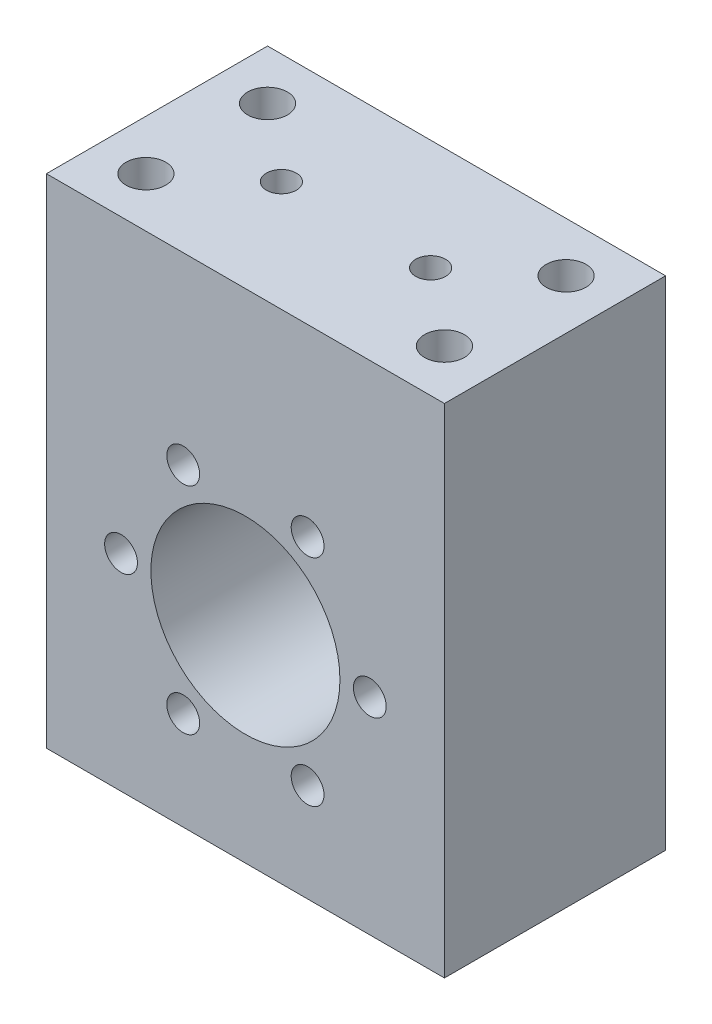
ISO-10303-21;
HEADER;
FILE_DESCRIPTION(('STEP AP214'),'2;1');
FILE_NAME('part.step','',(''),(''),'','','');
FILE_SCHEMA(('AUTOMOTIVE_DESIGN { 1 0 10303 214 1 1 1 1 }'));
ENDSEC;
DATA;
#1=APPLICATION_CONTEXT('core data for automotive mechanical design processes');
#2=APPLICATION_PROTOCOL_DEFINITION('international standard','automotive_design',2000,#1);
#3=PRODUCT_CONTEXT('',#1,'mechanical');
#4=PRODUCT('Part','Part','',(#3));
#5=PRODUCT_RELATED_PRODUCT_CATEGORY('part','',(#4));
#6=PRODUCT_DEFINITION_FORMATION('','',#4);
#7=PRODUCT_DEFINITION_CONTEXT('part definition',#1,'design');
#8=PRODUCT_DEFINITION('design','',#6,#7);
#9=PRODUCT_DEFINITION_SHAPE('','',#8);
#10=(LENGTH_UNIT() NAMED_UNIT(*) SI_UNIT(.MILLI.,.METRE.));
#11=(NAMED_UNIT(*) PLANE_ANGLE_UNIT() SI_UNIT($,.RADIAN.));
#12=(NAMED_UNIT(*) SI_UNIT($,.STERADIAN.) SOLID_ANGLE_UNIT());
#13=UNCERTAINTY_MEASURE_WITH_UNIT(LENGTH_MEASURE(1.E-05),#10,'distance_accuracy_value','');
#14=(GEOMETRIC_REPRESENTATION_CONTEXT(3) GLOBAL_UNCERTAINTY_ASSIGNED_CONTEXT((#13)) GLOBAL_UNIT_ASSIGNED_CONTEXT((#10,
#11,#12)) REPRESENTATION_CONTEXT('',''));
#15=CARTESIAN_POINT('',(0.,0.,0.));
#16=DIRECTION('',(0.,0.,1.));
#17=DIRECTION('',(1.,0.,0.));
#18=AXIS2_PLACEMENT_3D('',#15,#16,#17);
#19=CARTESIAN_POINT('',(40.,-58.6,22.225));
#20=DIRECTION('',(-1.,0.,0.));
#21=DIRECTION('',(0.,0.,1.));
#22=AXIS2_PLACEMENT_3D('',#19,#20,#21);
#23=PLANE('',#22);
#24=DIRECTION('',(0.,1.,0.));
#25=VECTOR('',#24,1.);
#26=CARTESIAN_POINT('',(40.,-58.6,22.225));
#27=LINE('',#26,#25);
#28=CARTESIAN_POINT('',(40.,-41.4,22.225));
#29=VERTEX_POINT('',#28);
#30=CARTESIAN_POINT('',(40.,58.6,22.225));
#31=VERTEX_POINT('',#30);
#32=EDGE_CURVE('E98',#29,#31,#27,.T.);
#33=ORIENTED_EDGE('',*,*,#32,.F.);
#34=DIRECTION('',(0.,0.,1.));
#35=VECTOR('',#34,1.);
#36=CARTESIAN_POINT('',(40.,-41.4,-22.225));
#37=LINE('',#36,#35);
#38=CARTESIAN_POINT('',(40.,-41.4,-22.225));
#39=VERTEX_POINT('',#38);
#40=EDGE_CURVE('E213',#39,#29,#37,.T.);
#41=ORIENTED_EDGE('',*,*,#40,.F.);
#42=DIRECTION('',(0.,1.,0.));
#43=VECTOR('',#42,1.);
#44=CARTESIAN_POINT('',(40.,-58.6,-22.225));
#45=LINE('',#44,#43);
#46=CARTESIAN_POINT('',(40.,58.6,-22.225));
#47=VERTEX_POINT('',#46);
#48=EDGE_CURVE('E87',#39,#47,#45,.T.);
#49=ORIENTED_EDGE('',*,*,#48,.T.);
#50=DIRECTION('',(0.,0.,-1.));
#51=VECTOR('',#50,1.);
#52=CARTESIAN_POINT('',(40.,58.6,22.225));
#53=LINE('',#52,#51);
#54=EDGE_CURVE('E11',#31,#47,#53,.T.);
#55=ORIENTED_EDGE('',*,*,#54,.F.);
#56=EDGE_LOOP('',(#33,#41,#49,#55));
#57=FACE_BOUND('',#56,.T.);
#58=ADVANCED_FACE('F41',(#57),#23,.F.);
#59=CARTESIAN_POINT('',(-40.,58.6,22.225));
#60=DIRECTION('',(0.,-1.,0.));
#61=DIRECTION('',(0.,0.,-1.));
#62=AXIS2_PLACEMENT_3D('',#59,#60,#61);
#63=PLANE('',#62);
#64=CARTESIAN_POINT('',(15.,58.6,0.));
#65=DIRECTION('',(0.,1.,0.));
#66=DIRECTION('',(0.,0.,1.));
#67=AXIS2_PLACEMENT_3D('',#64,#65,#66);
#68=CIRCLE('',#67,3.);
#69=CARTESIAN_POINT('',(15.,58.6,3.));
#70=VERTEX_POINT('',#69);
#71=EDGE_CURVE('E206',#70,#70,#68,.T.);
#72=ORIENTED_EDGE('',*,*,#71,.F.);
#73=EDGE_LOOP('',(#72));
#74=FACE_BOUND('',#73,.T.);
#75=CARTESIAN_POINT('',(-15.,58.6,0.));
#76=DIRECTION('',(0.,1.,0.));
#77=DIRECTION('',(0.,0.,1.));
#78=AXIS2_PLACEMENT_3D('',#75,#76,#77);
#79=CIRCLE('',#78,3.);
#80=CARTESIAN_POINT('',(-15.,58.6,3.));
#81=VERTEX_POINT('',#80);
#82=EDGE_CURVE('E198',#81,#81,#79,.T.);
#83=ORIENTED_EDGE('',*,*,#82,.F.);
#84=EDGE_LOOP('',(#83));
#85=FACE_BOUND('',#84,.T.);
#86=CARTESIAN_POINT('',(30.,58.6,12.225));
#87=DIRECTION('',(0.,1.,0.));
#88=DIRECTION('',(0.,0.,1.));
#89=AXIS2_PLACEMENT_3D('',#86,#87,#88);
#90=CIRCLE('',#89,4.);
#91=CARTESIAN_POINT('',(30.,58.6,16.225));
#92=VERTEX_POINT('',#91);
#93=EDGE_CURVE('E190',#92,#92,#90,.T.);
#94=ORIENTED_EDGE('',*,*,#93,.F.);
#95=EDGE_LOOP('',(#94));
#96=FACE_BOUND('',#95,.T.);
#97=CARTESIAN_POINT('',(-30.,58.6,12.225));
#98=DIRECTION('',(0.,1.,0.));
#99=DIRECTION('',(0.,0.,1.));
#100=AXIS2_PLACEMENT_3D('',#97,#98,#99);
#101=CIRCLE('',#100,4.);
#102=CARTESIAN_POINT('',(-30.,58.6,16.225));
#103=VERTEX_POINT('',#102);
#104=EDGE_CURVE('E182',#103,#103,#101,.T.);
#105=ORIENTED_EDGE('',*,*,#104,.F.);
#106=EDGE_LOOP('',(#105));
#107=FACE_BOUND('',#106,.T.);
#108=CARTESIAN_POINT('',(30.,58.6,-12.225));
#109=DIRECTION('',(0.,1.,0.));
#110=DIRECTION('',(0.,0.,1.));
#111=AXIS2_PLACEMENT_3D('',#108,#109,#110);
#112=CIRCLE('',#111,4.);
#113=CARTESIAN_POINT('',(30.,58.6,-8.225));
#114=VERTEX_POINT('',#113);
#115=EDGE_CURVE('E174',#114,#114,#112,.T.);
#116=ORIENTED_EDGE('',*,*,#115,.F.);
#117=EDGE_LOOP('',(#116));
#118=FACE_BOUND('',#117,.T.);
#119=CARTESIAN_POINT('',(-30.,58.6,-12.225));
#120=DIRECTION('',(0.,1.,0.));
#121=DIRECTION('',(0.,0.,1.));
#122=AXIS2_PLACEMENT_3D('',#119,#120,#121);
#123=CIRCLE('',#122,4.);
#124=CARTESIAN_POINT('',(-30.,58.6,-8.225));
#125=VERTEX_POINT('',#124);
#126=EDGE_CURVE('E166',#125,#125,#123,.T.);
#127=ORIENTED_EDGE('',*,*,#126,.F.);
#128=EDGE_LOOP('',(#127));
#129=FACE_BOUND('',#128,.T.);
#130=DIRECTION('',(-1.,0.,0.));
#131=VECTOR('',#130,1.);
#132=CARTESIAN_POINT('',(-40.,58.6,-22.225));
#133=LINE('',#132,#131);
#134=CARTESIAN_POINT('',(-40.,58.6,-22.225));
#135=VERTEX_POINT('',#134);
#136=EDGE_CURVE('E77',#47,#135,#133,.T.);
#137=ORIENTED_EDGE('',*,*,#136,.T.);
#138=DIRECTION('',(0.,0.,-1.));
#139=VECTOR('',#138,1.);
#140=CARTESIAN_POINT('',(-40.,58.6,22.225));
#141=LINE('',#140,#139);
#142=CARTESIAN_POINT('',(-40.,58.6,22.225));
#143=VERTEX_POINT('',#142);
#144=EDGE_CURVE('E49',#143,#135,#141,.T.);
#145=ORIENTED_EDGE('',*,*,#144,.F.);
#146=DIRECTION('',(-1.,0.,0.));
#147=VECTOR('',#146,1.);
#148=CARTESIAN_POINT('',(-40.,58.6,22.225));
#149=LINE('',#148,#147);
#150=EDGE_CURVE('E65',#31,#143,#149,.T.);
#151=ORIENTED_EDGE('',*,*,#150,.F.);
#152=ORIENTED_EDGE('',*,*,#54,.T.);
#153=EDGE_LOOP('',(#137,#145,#151,#152));
#154=FACE_BOUND('',#153,.T.);
#155=ADVANCED_FACE('F79',(#74,#85,#96,#107,#118,#129,#154),#63,.F.);
#156=CARTESIAN_POINT('',(-40.,-58.6,22.225));
#157=DIRECTION('',(1.,0.,0.));
#158=DIRECTION('',(0.,0.,-1.));
#159=AXIS2_PLACEMENT_3D('',#156,#157,#158);
#160=PLANE('',#159);
#161=DIRECTION('',(0.,-1.,0.));
#162=VECTOR('',#161,1.);
#163=CARTESIAN_POINT('',(-40.,-58.6,-22.225));
#164=LINE('',#163,#162);
#165=CARTESIAN_POINT('',(-40.,-41.4,-22.225));
#166=VERTEX_POINT('',#165);
#167=EDGE_CURVE('E86',#135,#166,#164,.T.);
#168=ORIENTED_EDGE('',*,*,#167,.T.);
#169=DIRECTION('',(0.,0.,1.));
#170=VECTOR('',#169,1.);
#171=CARTESIAN_POINT('',(-40.,-41.4,-22.225));
#172=LINE('',#171,#170);
#173=CARTESIAN_POINT('',(-40.,-41.4,22.225));
#174=VERTEX_POINT('',#173);
#175=EDGE_CURVE('E56',#166,#174,#172,.T.);
#176=ORIENTED_EDGE('',*,*,#175,.T.);
#177=DIRECTION('',(0.,-1.,0.));
#178=VECTOR('',#177,1.);
#179=CARTESIAN_POINT('',(-40.,-58.6,22.225));
#180=LINE('',#179,#178);
#181=EDGE_CURVE('E92',#143,#174,#180,.T.);
#182=ORIENTED_EDGE('',*,*,#181,.F.);
#183=ORIENTED_EDGE('',*,*,#144,.T.);
#184=EDGE_LOOP('',(#168,#176,#182,#183));
#185=FACE_BOUND('',#184,.T.);
#186=ADVANCED_FACE('F91',(#185),#160,.F.);
#187=CARTESIAN_POINT('',(0.,0.,22.225));
#188=DIRECTION('',(0.,0.,-1.));
#189=DIRECTION('',(-1.,0.,0.));
#190=AXIS2_PLACEMENT_3D('',#187,#188,#189);
#191=PLANE('',#190);
#192=CARTESIAN_POINT('',(25.,2.9316826744008E-13,22.225));
#193=DIRECTION('',(0.,0.,1.));
#194=DIRECTION('',(0.50000000000001,-0.866025403784433,0.));
#195=AXIS2_PLACEMENT_3D('',#192,#193,#194);
#196=CIRCLE('',#195,3.3);
#197=CARTESIAN_POINT('',(26.65,-2.85788383248834,22.225));
#198=VERTEX_POINT('',#197);
#199=EDGE_CURVE('E158',#198,#198,#196,.T.);
#200=ORIENTED_EDGE('',*,*,#199,.F.);
#201=EDGE_LOOP('',(#200));
#202=FACE_BOUND('',#201,.T.);
#203=CARTESIAN_POINT('',(12.5000000000002,-21.6506350946108,22.225));
#204=DIRECTION('',(0.,0.,1.));
#205=DIRECTION('',(-0.499999999999992,-0.866025403784443,0.));
#206=AXIS2_PLACEMENT_3D('',#203,#204,#205);
#207=CIRCLE('',#206,3.3);
#208=CARTESIAN_POINT('',(10.8500000000002,-24.5085189270995,22.225));
#209=VERTEX_POINT('',#208);
#210=EDGE_CURVE('E150',#209,#209,#207,.T.);
#211=ORIENTED_EDGE('',*,*,#210,.F.);
#212=EDGE_LOOP('',(#211));
#213=FACE_BOUND('',#212,.T.);
#214=CARTESIAN_POINT('',(-12.5,-21.650635094611,22.225));
#215=DIRECTION('',(0.,0.,1.));
#216=DIRECTION('',(-1.,0.,0.));
#217=AXIS2_PLACEMENT_3D('',#214,#215,#216);
#218=CIRCLE('',#217,3.3);
#219=CARTESIAN_POINT('',(-15.8,-21.650635094611,22.225));
#220=VERTEX_POINT('',#219);
#221=EDGE_CURVE('E142',#220,#220,#218,.T.);
#222=ORIENTED_EDGE('',*,*,#221,.F.);
#223=EDGE_LOOP('',(#222));
#224=FACE_BOUND('',#223,.T.);
#225=CARTESIAN_POINT('',(-25.,-1.16226472890446E-13,22.225));
#226=DIRECTION('',(0.,0.,1.));
#227=DIRECTION('',(-0.500000000000004,0.866025403784436,0.));
#228=AXIS2_PLACEMENT_3D('',#225,#226,#227);
#229=CIRCLE('',#228,3.3);
#230=CARTESIAN_POINT('',(-26.65,2.85788383248853,22.225));
#231=VERTEX_POINT('',#230);
#232=EDGE_CURVE('E134',#231,#231,#229,.T.);
#233=ORIENTED_EDGE('',*,*,#232,.F.);
#234=EDGE_LOOP('',(#233));
#235=FACE_BOUND('',#234,.T.);
#236=CARTESIAN_POINT('',(-12.5000000000001,21.6506350946109,22.225));
#237=DIRECTION('',(0.,0.,1.));
#238=DIRECTION('',(0.499999999999998,0.86602540378444,0.));
#239=AXIS2_PLACEMENT_3D('',#236,#237,#238);
#240=CIRCLE('',#239,3.3);
#241=CARTESIAN_POINT('',(-10.8500000000001,24.5085189270996,22.225));
#242=VERTEX_POINT('',#241);
#243=EDGE_CURVE('E126',#242,#242,#240,.T.);
#244=ORIENTED_EDGE('',*,*,#243,.F.);
#245=EDGE_LOOP('',(#244));
#246=FACE_BOUND('',#245,.T.);
#247=CARTESIAN_POINT('',(12.5,21.650635094611,22.225));
#248=DIRECTION('',(0.,0.,1.));
#249=DIRECTION('',(1.,0.,0.));
#250=AXIS2_PLACEMENT_3D('',#247,#248,#249);
#251=CIRCLE('',#250,3.3);
#252=CARTESIAN_POINT('',(15.8,21.650635094611,22.225));
#253=VERTEX_POINT('',#252);
#254=EDGE_CURVE('E118',#253,#253,#251,.T.);
#255=ORIENTED_EDGE('',*,*,#254,.F.);
#256=EDGE_LOOP('',(#255));
#257=FACE_BOUND('',#256,.T.);
#258=CARTESIAN_POINT('',(0.,0.,22.225));
#259=DIRECTION('',(0.,0.,1.));
#260=DIRECTION('',(1.,0.,0.));
#261=AXIS2_PLACEMENT_3D('',#258,#259,#260);
#262=CIRCLE('',#261,19.);
#263=CARTESIAN_POINT('',(19.,0.,22.225));
#264=VERTEX_POINT('',#263);
#265=EDGE_CURVE('E110',#264,#264,#262,.T.);
#266=ORIENTED_EDGE('',*,*,#265,.F.);
#267=EDGE_LOOP('',(#266));
#268=FACE_BOUND('',#267,.T.);
#269=ORIENTED_EDGE('',*,*,#181,.T.);
#270=DIRECTION('',(-1.,0.,0.));
#271=VECTOR('',#270,1.);
#272=CARTESIAN_POINT('',(-40.,-41.4,22.225));
#273=LINE('',#272,#271);
#274=EDGE_CURVE('E219',#29,#174,#273,.T.);
#275=ORIENTED_EDGE('',*,*,#274,.F.);
#276=ORIENTED_EDGE('',*,*,#32,.T.);
#277=ORIENTED_EDGE('',*,*,#150,.T.);
#278=EDGE_LOOP('',(#269,#275,#276,#277));
#279=FACE_BOUND('',#278,.T.);
#280=ADVANCED_FACE('F229',(#202,#213,#224,#235,#246,#257,#268,#279),#191,.F.);
#281=CARTESIAN_POINT('',(0.,0.,-22.225));
#282=DIRECTION('',(0.,0.,-1.));
#283=DIRECTION('',(-1.,0.,0.));
#284=AXIS2_PLACEMENT_3D('',#281,#282,#283);
#285=PLANE('',#284);
#286=DIRECTION('',(-1.,0.,0.));
#287=VECTOR('',#286,1.);
#288=CARTESIAN_POINT('',(-40.,-41.4,-22.225));
#289=LINE('',#288,#287);
#290=EDGE_CURVE('E96',#39,#166,#289,.T.);
#291=ORIENTED_EDGE('',*,*,#290,.T.);
#292=ORIENTED_EDGE('',*,*,#167,.F.);
#293=ORIENTED_EDGE('',*,*,#136,.F.);
#294=ORIENTED_EDGE('',*,*,#48,.F.);
#295=EDGE_LOOP('',(#291,#292,#293,#294));
#296=FACE_BOUND('',#295,.T.);
#297=CARTESIAN_POINT('',(0.,0.,-22.225));
#298=DIRECTION('',(0.,0.,1.));
#299=DIRECTION('',(1.,0.,0.));
#300=AXIS2_PLACEMENT_3D('',#297,#298,#299);
#301=CIRCLE('',#300,19.);
#302=CARTESIAN_POINT('',(19.,0.,-22.225));
#303=VERTEX_POINT('',#302);
#304=EDGE_CURVE('E105',#303,#303,#301,.T.);
#305=ORIENTED_EDGE('',*,*,#304,.T.);
#306=EDGE_LOOP('',(#305));
#307=FACE_BOUND('',#306,.T.);
#308=ADVANCED_FACE('F94',(#296,#307),#285,.T.);
#309=CARTESIAN_POINT('',(0.,0.,-22.225));
#310=DIRECTION('',(0.,0.,1.));
#311=DIRECTION('',(1.,0.,0.));
#312=AXIS2_PLACEMENT_3D('',#309,#310,#311);
#313=CYLINDRICAL_SURFACE('',#312,19.);
#314=ORIENTED_EDGE('',*,*,#304,.F.);
#315=EDGE_LOOP('',(#314));
#316=FACE_BOUND('',#315,.T.);
#317=ORIENTED_EDGE('',*,*,#265,.T.);
#318=EDGE_LOOP('',(#317));
#319=FACE_BOUND('',#318,.T.);
#320=ADVANCED_FACE('F237',(#316,#319),#313,.F.);
#321=CARTESIAN_POINT('',(12.5,21.650635094611,-12.275));
#322=DIRECTION('',(0.,0.,1.));
#323=DIRECTION('',(1.,0.,0.));
#324=AXIS2_PLACEMENT_3D('',#321,#322,#323);
#325=CYLINDRICAL_SURFACE('',#324,3.3);
#326=CARTESIAN_POINT('',(12.5,21.650635094611,-12.275));
#327=DIRECTION('',(0.,0.,1.));
#328=DIRECTION('',(1.,0.,0.));
#329=AXIS2_PLACEMENT_3D('',#326,#327,#328);
#330=CIRCLE('',#329,3.3);
#331=CARTESIAN_POINT('',(15.8,21.650635094611,-12.275));
#332=VERTEX_POINT('',#331);
#333=EDGE_CURVE('E114',#332,#332,#330,.T.);
#334=ORIENTED_EDGE('',*,*,#333,.F.);
#335=EDGE_LOOP('',(#334));
#336=FACE_BOUND('',#335,.T.);
#337=ORIENTED_EDGE('',*,*,#254,.T.);
#338=EDGE_LOOP('',(#337));
#339=FACE_BOUND('',#338,.T.);
#340=ADVANCED_FACE('F322',(#336,#339),#325,.F.);
#341=CARTESIAN_POINT('',(12.5,21.650635094611,-12.275));
#342=DIRECTION('',(0.,0.,1.));
#343=DIRECTION('',(1.,0.,0.));
#344=AXIS2_PLACEMENT_3D('',#341,#342,#343);
#345=PLANE('',#344);
#346=ORIENTED_EDGE('',*,*,#333,.T.);
#347=EDGE_LOOP('',(#346));
#348=FACE_BOUND('',#347,.T.);
#349=ADVANCED_FACE('F318',(#348),#345,.T.);
#350=CARTESIAN_POINT('',(-12.5000000000001,21.6506350946109,-12.275));
#351=DIRECTION('',(0.,0.,1.));
#352=DIRECTION('',(1.,0.,0.));
#353=AXIS2_PLACEMENT_3D('',#350,#351,#352);
#354=CYLINDRICAL_SURFACE('',#353,3.3);
#355=CARTESIAN_POINT('',(-12.5000000000001,21.6506350946109,-12.275));
#356=DIRECTION('',(0.,0.,1.));
#357=DIRECTION('',(0.499999999999998,0.86602540378444,0.));
#358=AXIS2_PLACEMENT_3D('',#355,#356,#357);
#359=CIRCLE('',#358,3.3);
#360=CARTESIAN_POINT('',(-10.8500000000001,24.5085189270996,-12.275));
#361=VERTEX_POINT('',#360);
#362=EDGE_CURVE('E122',#361,#361,#359,.T.);
#363=ORIENTED_EDGE('',*,*,#362,.F.);
#364=EDGE_LOOP('',(#363));
#365=FACE_BOUND('',#364,.T.);
#366=ORIENTED_EDGE('',*,*,#243,.T.);
#367=EDGE_LOOP('',(#366));
#368=FACE_BOUND('',#367,.T.);
#369=ADVANCED_FACE('F314',(#365,#368),#354,.F.);
#370=CARTESIAN_POINT('',(-12.5000000000001,21.6506350946109,-12.275));
#371=DIRECTION('',(0.,0.,1.));
#372=DIRECTION('',(0.499999999999998,0.86602540378444,0.));
#373=AXIS2_PLACEMENT_3D('',#370,#371,#372);
#374=PLANE('',#373);
#375=ORIENTED_EDGE('',*,*,#362,.T.);
#376=EDGE_LOOP('',(#375));
#377=FACE_BOUND('',#376,.T.);
#378=ADVANCED_FACE('F310',(#377),#374,.T.);
#379=CARTESIAN_POINT('',(-25.,-1.16226472890446E-13,-12.275));
#380=DIRECTION('',(0.,0.,1.));
#381=DIRECTION('',(1.,0.,0.));
#382=AXIS2_PLACEMENT_3D('',#379,#380,#381);
#383=CYLINDRICAL_SURFACE('',#382,3.3);
#384=CARTESIAN_POINT('',(-25.,-1.16226472890446E-13,-12.275));
#385=DIRECTION('',(0.,0.,1.));
#386=DIRECTION('',(-0.500000000000004,0.866025403784436,0.));
#387=AXIS2_PLACEMENT_3D('',#384,#385,#386);
#388=CIRCLE('',#387,3.3);
#389=CARTESIAN_POINT('',(-26.65,2.85788383248853,-12.275));
#390=VERTEX_POINT('',#389);
#391=EDGE_CURVE('E130',#390,#390,#388,.T.);
#392=ORIENTED_EDGE('',*,*,#391,.F.);
#393=EDGE_LOOP('',(#392));
#394=FACE_BOUND('',#393,.T.);
#395=ORIENTED_EDGE('',*,*,#232,.T.);
#396=EDGE_LOOP('',(#395));
#397=FACE_BOUND('',#396,.T.);
#398=ADVANCED_FACE('F306',(#394,#397),#383,.F.);
#399=CARTESIAN_POINT('',(-25.,-1.16226472890446E-13,-12.275));
#400=DIRECTION('',(0.,0.,1.));
#401=DIRECTION('',(-0.500000000000004,0.866025403784436,0.));
#402=AXIS2_PLACEMENT_3D('',#399,#400,#401);
#403=PLANE('',#402);
#404=ORIENTED_EDGE('',*,*,#391,.T.);
#405=EDGE_LOOP('',(#404));
#406=FACE_BOUND('',#405,.T.);
#407=ADVANCED_FACE('F302',(#406),#403,.T.);
#408=CARTESIAN_POINT('',(-12.5,-21.650635094611,-12.275));
#409=DIRECTION('',(0.,0.,1.));
#410=DIRECTION('',(1.,0.,0.));
#411=AXIS2_PLACEMENT_3D('',#408,#409,#410);
#412=CYLINDRICAL_SURFACE('',#411,3.3);
#413=CARTESIAN_POINT('',(-12.5,-21.650635094611,-12.275));
#414=DIRECTION('',(0.,0.,1.));
#415=DIRECTION('',(-1.,0.,0.));
#416=AXIS2_PLACEMENT_3D('',#413,#414,#415);
#417=CIRCLE('',#416,3.3);
#418=CARTESIAN_POINT('',(-15.8,-21.650635094611,-12.275));
#419=VERTEX_POINT('',#418);
#420=EDGE_CURVE('E138',#419,#419,#417,.T.);
#421=ORIENTED_EDGE('',*,*,#420,.F.);
#422=EDGE_LOOP('',(#421));
#423=FACE_BOUND('',#422,.T.);
#424=ORIENTED_EDGE('',*,*,#221,.T.);
#425=EDGE_LOOP('',(#424));
#426=FACE_BOUND('',#425,.T.);
#427=ADVANCED_FACE('F298',(#423,#426),#412,.F.);
#428=CARTESIAN_POINT('',(-12.5,-21.650635094611,-12.275));
#429=DIRECTION('',(0.,0.,1.));
#430=DIRECTION('',(-1.,0.,0.));
#431=AXIS2_PLACEMENT_3D('',#428,#429,#430);
#432=PLANE('',#431);
#433=ORIENTED_EDGE('',*,*,#420,.T.);
#434=EDGE_LOOP('',(#433));
#435=FACE_BOUND('',#434,.T.);
#436=ADVANCED_FACE('F294',(#435),#432,.T.);
#437=CARTESIAN_POINT('',(12.5000000000002,-21.6506350946108,-12.275));
#438=DIRECTION('',(0.,0.,1.));
#439=DIRECTION('',(1.,0.,0.));
#440=AXIS2_PLACEMENT_3D('',#437,#438,#439);
#441=CYLINDRICAL_SURFACE('',#440,3.3);
#442=CARTESIAN_POINT('',(12.5000000000002,-21.6506350946108,-12.275));
#443=DIRECTION('',(0.,0.,1.));
#444=DIRECTION('',(-0.499999999999992,-0.866025403784443,0.));
#445=AXIS2_PLACEMENT_3D('',#442,#443,#444);
#446=CIRCLE('',#445,3.3);
#447=CARTESIAN_POINT('',(10.8500000000002,-24.5085189270995,-12.275));
#448=VERTEX_POINT('',#447);
#449=EDGE_CURVE('E146',#448,#448,#446,.T.);
#450=ORIENTED_EDGE('',*,*,#449,.F.);
#451=EDGE_LOOP('',(#450));
#452=FACE_BOUND('',#451,.T.);
#453=ORIENTED_EDGE('',*,*,#210,.T.);
#454=EDGE_LOOP('',(#453));
#455=FACE_BOUND('',#454,.T.);
#456=ADVANCED_FACE('F290',(#452,#455),#441,.F.);
#457=CARTESIAN_POINT('',(12.5000000000002,-21.6506350946108,-12.275));
#458=DIRECTION('',(0.,0.,1.));
#459=DIRECTION('',(-0.499999999999992,-0.866025403784443,0.));
#460=AXIS2_PLACEMENT_3D('',#457,#458,#459);
#461=PLANE('',#460);
#462=ORIENTED_EDGE('',*,*,#449,.T.);
#463=EDGE_LOOP('',(#462));
#464=FACE_BOUND('',#463,.T.);
#465=ADVANCED_FACE('F286',(#464),#461,.T.);
#466=CARTESIAN_POINT('',(25.,2.9316826744008E-13,-12.275));
#467=DIRECTION('',(0.,0.,1.));
#468=DIRECTION('',(1.,0.,0.));
#469=AXIS2_PLACEMENT_3D('',#466,#467,#468);
#470=CYLINDRICAL_SURFACE('',#469,3.3);
#471=CARTESIAN_POINT('',(25.,2.9316826744008E-13,-12.275));
#472=DIRECTION('',(0.,0.,1.));
#473=DIRECTION('',(0.50000000000001,-0.866025403784433,0.));
#474=AXIS2_PLACEMENT_3D('',#471,#472,#473);
#475=CIRCLE('',#474,3.3);
#476=CARTESIAN_POINT('',(26.65,-2.85788383248834,-12.275));
#477=VERTEX_POINT('',#476);
#478=EDGE_CURVE('E154',#477,#477,#475,.T.);
#479=ORIENTED_EDGE('',*,*,#478,.F.);
#480=EDGE_LOOP('',(#479));
#481=FACE_BOUND('',#480,.T.);
#482=ORIENTED_EDGE('',*,*,#199,.T.);
#483=EDGE_LOOP('',(#482));
#484=FACE_BOUND('',#483,.T.);
#485=ADVANCED_FACE('F278',(#481,#484),#470,.F.);
#486=CARTESIAN_POINT('',(25.,2.9316826744008E-13,-12.275));
#487=DIRECTION('',(0.,0.,1.));
#488=DIRECTION('',(0.50000000000001,-0.866025403784433,0.));
#489=AXIS2_PLACEMENT_3D('',#486,#487,#488);
#490=PLANE('',#489);
#491=ORIENTED_EDGE('',*,*,#478,.T.);
#492=EDGE_LOOP('',(#491));
#493=FACE_BOUND('',#492,.T.);
#494=ADVANCED_FACE('F268',(#493),#490,.T.);
#495=CARTESIAN_POINT('',(-30.,28.6,-12.225));
#496=DIRECTION('',(0.,1.,0.));
#497=DIRECTION('',(0.,0.,1.));
#498=AXIS2_PLACEMENT_3D('',#495,#496,#497);
#499=CYLINDRICAL_SURFACE('',#498,4.);
#500=CARTESIAN_POINT('',(-30.,28.6,-12.225));
#501=DIRECTION('',(0.,1.,0.));
#502=DIRECTION('',(0.,0.,1.));
#503=AXIS2_PLACEMENT_3D('',#500,#501,#502);
#504=CIRCLE('',#503,4.);
#505=CARTESIAN_POINT('',(-30.,28.6,-8.225));
#506=VERTEX_POINT('',#505);
#507=EDGE_CURVE('E162',#506,#506,#504,.T.);
#508=ORIENTED_EDGE('',*,*,#507,.F.);
#509=EDGE_LOOP('',(#508));
#510=FACE_BOUND('',#509,.T.);
#511=ORIENTED_EDGE('',*,*,#126,.T.);
#512=EDGE_LOOP('',(#511));
#513=FACE_BOUND('',#512,.T.);
#514=ADVANCED_FACE('F265',(#510,#513),#499,.F.);
#515=CARTESIAN_POINT('',(-30.,28.6,-12.225));
#516=DIRECTION('',(0.,1.,0.));
#517=DIRECTION('',(0.,0.,1.));
#518=AXIS2_PLACEMENT_3D('',#515,#516,#517);
#519=PLANE('',#518);
#520=ORIENTED_EDGE('',*,*,#507,.T.);
#521=EDGE_LOOP('',(#520));
#522=FACE_BOUND('',#521,.T.);
#523=ADVANCED_FACE('F267',(#522),#519,.T.);
#524=CARTESIAN_POINT('',(30.,28.6,-12.225));
#525=DIRECTION('',(0.,1.,0.));
#526=DIRECTION('',(0.,0.,1.));
#527=AXIS2_PLACEMENT_3D('',#524,#525,#526);
#528=CYLINDRICAL_SURFACE('',#527,4.);
#529=CARTESIAN_POINT('',(30.,28.6,-12.225));
#530=DIRECTION('',(0.,1.,0.));
#531=DIRECTION('',(0.,0.,1.));
#532=AXIS2_PLACEMENT_3D('',#529,#530,#531);
#533=CIRCLE('',#532,4.);
#534=CARTESIAN_POINT('',(30.,28.6,-8.225));
#535=VERTEX_POINT('',#534);
#536=EDGE_CURVE('E170',#535,#535,#533,.T.);
#537=ORIENTED_EDGE('',*,*,#536,.F.);
#538=EDGE_LOOP('',(#537));
#539=FACE_BOUND('',#538,.T.);
#540=ORIENTED_EDGE('',*,*,#115,.T.);
#541=EDGE_LOOP('',(#540));
#542=FACE_BOUND('',#541,.T.);
#543=ADVANCED_FACE('F275',(#539,#542),#528,.F.);
#544=CARTESIAN_POINT('',(30.,28.6,-12.225));
#545=DIRECTION('',(0.,1.,0.));
#546=DIRECTION('',(0.,0.,1.));
#547=AXIS2_PLACEMENT_3D('',#544,#545,#546);
#548=PLANE('',#547);
#549=ORIENTED_EDGE('',*,*,#536,.T.);
#550=EDGE_LOOP('',(#549));
#551=FACE_BOUND('',#550,.T.);
#552=ADVANCED_FACE('F416',(#551),#548,.T.);
#553=CARTESIAN_POINT('',(-30.,28.6,12.225));
#554=DIRECTION('',(0.,1.,0.));
#555=DIRECTION('',(0.,0.,1.));
#556=AXIS2_PLACEMENT_3D('',#553,#554,#555);
#557=CYLINDRICAL_SURFACE('',#556,4.);
#558=CARTESIAN_POINT('',(-30.,28.6,12.225));
#559=DIRECTION('',(0.,1.,0.));
#560=DIRECTION('',(0.,0.,1.));
#561=AXIS2_PLACEMENT_3D('',#558,#559,#560);
#562=CIRCLE('',#561,4.);
#563=CARTESIAN_POINT('',(-30.,28.6,16.225));
#564=VERTEX_POINT('',#563);
#565=EDGE_CURVE('E178',#564,#564,#562,.T.);
#566=ORIENTED_EDGE('',*,*,#565,.F.);
#567=EDGE_LOOP('',(#566));
#568=FACE_BOUND('',#567,.T.);
#569=ORIENTED_EDGE('',*,*,#104,.T.);
#570=EDGE_LOOP('',(#569));
#571=FACE_BOUND('',#570,.T.);
#572=ADVANCED_FACE('F425',(#568,#571),#557,.F.);
#573=CARTESIAN_POINT('',(-30.,28.6,12.225));
#574=DIRECTION('',(0.,1.,0.));
#575=DIRECTION('',(0.,0.,1.));
#576=AXIS2_PLACEMENT_3D('',#573,#574,#575);
#577=PLANE('',#576);
#578=ORIENTED_EDGE('',*,*,#565,.T.);
#579=EDGE_LOOP('',(#578));
#580=FACE_BOUND('',#579,.T.);
#581=ADVANCED_FACE('F435',(#580),#577,.T.);
#582=CARTESIAN_POINT('',(30.,28.6,12.225));
#583=DIRECTION('',(0.,1.,0.));
#584=DIRECTION('',(0.,0.,1.));
#585=AXIS2_PLACEMENT_3D('',#582,#583,#584);
#586=CYLINDRICAL_SURFACE('',#585,4.);
#587=CARTESIAN_POINT('',(30.,28.6,12.225));
#588=DIRECTION('',(0.,1.,0.));
#589=DIRECTION('',(0.,0.,1.));
#590=AXIS2_PLACEMENT_3D('',#587,#588,#589);
#591=CIRCLE('',#590,4.);
#592=CARTESIAN_POINT('',(30.,28.6,16.225));
#593=VERTEX_POINT('',#592);
#594=EDGE_CURVE('E186',#593,#593,#591,.T.);
#595=ORIENTED_EDGE('',*,*,#594,.F.);
#596=EDGE_LOOP('',(#595));
#597=FACE_BOUND('',#596,.T.);
#598=ORIENTED_EDGE('',*,*,#93,.T.);
#599=EDGE_LOOP('',(#598));
#600=FACE_BOUND('',#599,.T.);
#601=ADVANCED_FACE('F445',(#597,#600),#586,.F.);
#602=CARTESIAN_POINT('',(30.,28.6,12.225));
#603=DIRECTION('',(0.,1.,0.));
#604=DIRECTION('',(0.,0.,1.));
#605=AXIS2_PLACEMENT_3D('',#602,#603,#604);
#606=PLANE('',#605);
#607=ORIENTED_EDGE('',*,*,#594,.T.);
#608=EDGE_LOOP('',(#607));
#609=FACE_BOUND('',#608,.T.);
#610=ADVANCED_FACE('F455',(#609),#606,.T.);
#611=CARTESIAN_POINT('',(-15.,28.6,0.));
#612=DIRECTION('',(0.,1.,0.));
#613=DIRECTION('',(0.,0.,1.));
#614=AXIS2_PLACEMENT_3D('',#611,#612,#613);
#615=CYLINDRICAL_SURFACE('',#614,3.);
#616=CARTESIAN_POINT('',(-15.,28.6,0.));
#617=DIRECTION('',(0.,1.,0.));
#618=DIRECTION('',(0.,0.,1.));
#619=AXIS2_PLACEMENT_3D('',#616,#617,#618);
#620=CIRCLE('',#619,3.);
#621=CARTESIAN_POINT('',(-15.,28.6,3.));
#622=VERTEX_POINT('',#621);
#623=EDGE_CURVE('E194',#622,#622,#620,.T.);
#624=ORIENTED_EDGE('',*,*,#623,.F.);
#625=EDGE_LOOP('',(#624));
#626=FACE_BOUND('',#625,.T.);
#627=ORIENTED_EDGE('',*,*,#82,.T.);
#628=EDGE_LOOP('',(#627));
#629=FACE_BOUND('',#628,.T.);
#630=ADVANCED_FACE('F465',(#626,#629),#615,.F.);
#631=CARTESIAN_POINT('',(-15.,28.6,0.));
#632=DIRECTION('',(0.,1.,0.));
#633=DIRECTION('',(0.,0.,1.));
#634=AXIS2_PLACEMENT_3D('',#631,#632,#633);
#635=PLANE('',#634);
#636=ORIENTED_EDGE('',*,*,#623,.T.);
#637=EDGE_LOOP('',(#636));
#638=FACE_BOUND('',#637,.T.);
#639=ADVANCED_FACE('F475',(#638),#635,.T.);
#640=CARTESIAN_POINT('',(15.,28.6,0.));
#641=DIRECTION('',(0.,1.,0.));
#642=DIRECTION('',(0.,0.,1.));
#643=AXIS2_PLACEMENT_3D('',#640,#641,#642);
#644=CYLINDRICAL_SURFACE('',#643,3.);
#645=CARTESIAN_POINT('',(15.,28.6,0.));
#646=DIRECTION('',(0.,1.,0.));
#647=DIRECTION('',(0.,0.,1.));
#648=AXIS2_PLACEMENT_3D('',#645,#646,#647);
#649=CIRCLE('',#648,3.);
#650=CARTESIAN_POINT('',(15.,28.6,3.));
#651=VERTEX_POINT('',#650);
#652=EDGE_CURVE('E202',#651,#651,#649,.T.);
#653=ORIENTED_EDGE('',*,*,#652,.F.);
#654=EDGE_LOOP('',(#653));
#655=FACE_BOUND('',#654,.T.);
#656=ORIENTED_EDGE('',*,*,#71,.T.);
#657=EDGE_LOOP('',(#656));
#658=FACE_BOUND('',#657,.T.);
#659=ADVANCED_FACE('F485',(#655,#658),#644,.F.);
#660=CARTESIAN_POINT('',(15.,28.6,0.));
#661=DIRECTION('',(0.,1.,0.));
#662=DIRECTION('',(0.,0.,1.));
#663=AXIS2_PLACEMENT_3D('',#660,#661,#662);
#664=PLANE('',#663);
#665=ORIENTED_EDGE('',*,*,#652,.T.);
#666=EDGE_LOOP('',(#665));
#667=FACE_BOUND('',#666,.T.);
#668=ADVANCED_FACE('F495',(#667),#664,.T.);
#669=CARTESIAN_POINT('',(-40.,-41.4,-22.225));
#670=DIRECTION('',(0.,1.,0.));
#671=DIRECTION('',(0.,0.,1.));
#672=AXIS2_PLACEMENT_3D('',#669,#670,#671);
#673=PLANE('',#672);
#674=ORIENTED_EDGE('',*,*,#274,.T.);
#675=ORIENTED_EDGE('',*,*,#175,.F.);
#676=ORIENTED_EDGE('',*,*,#290,.F.);
#677=ORIENTED_EDGE('',*,*,#40,.T.);
#678=EDGE_LOOP('',(#674,#675,#676,#677));
#679=FACE_BOUND('',#678,.T.);
#680=ADVANCED_FACE('F225',(#679),#673,.F.);
#681=CLOSED_SHELL('',(#58,#155,#186,#280,#308,#320,#340,#349,#369,#378,#398,#407,#427,#436,#456,
#465,#485,#494,#514,#523,#543,#552,#572,#581,#601,#610,#630,#639,#659,#668,#680));
#682=MANIFOLD_SOLID_BREP('B2',#681);
#683=ADVANCED_BREP_SHAPE_REPRESENTATION('',(#18,#682),#14);
#684=SHAPE_DEFINITION_REPRESENTATION(#9,#683);
ENDSEC;
END-ISO-10303-21;
